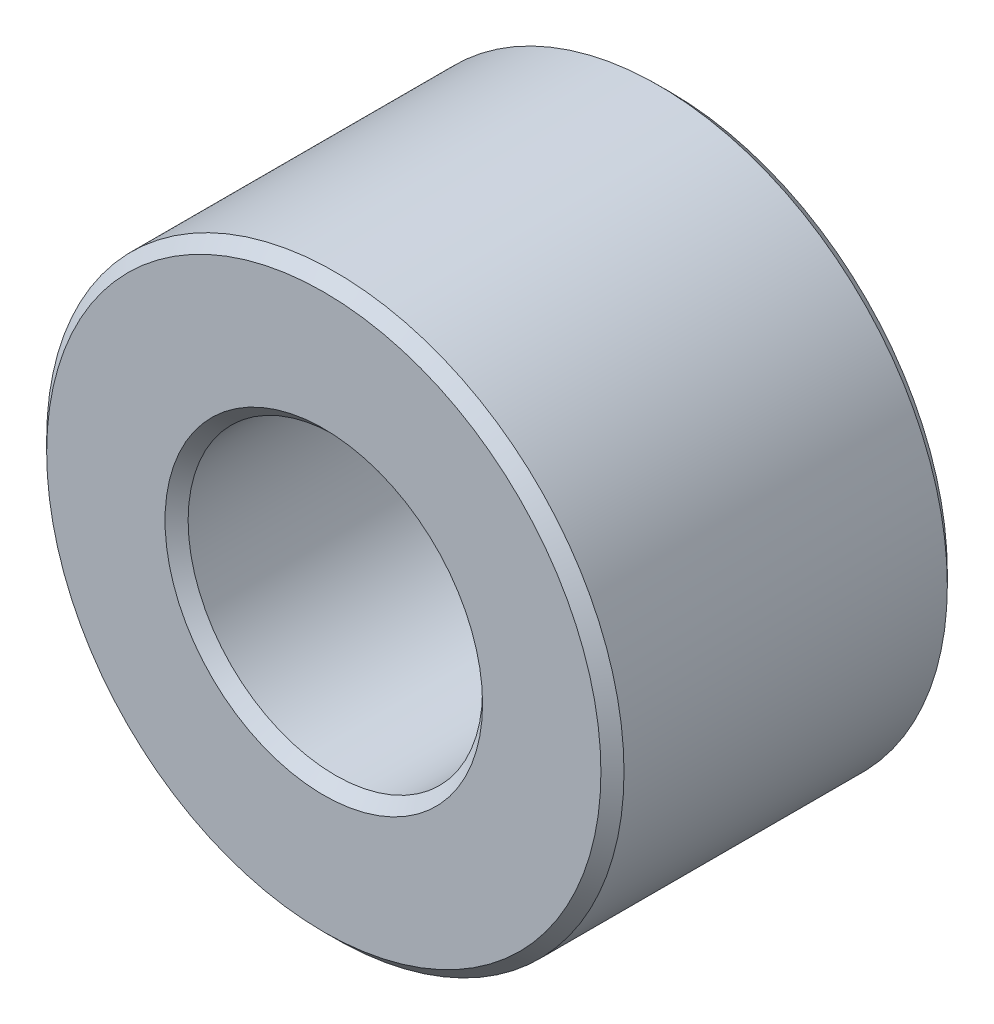
ISO-10303-21;
HEADER;
FILE_DESCRIPTION(('STEP AP214'),'2;1');
FILE_NAME('part.step','',(''),(''),'','','');
FILE_SCHEMA(('AUTOMOTIVE_DESIGN { 1 0 10303 214 1 1 1 1 }'));
ENDSEC;
DATA;
#1=APPLICATION_CONTEXT('core data for automotive mechanical design processes');
#2=APPLICATION_PROTOCOL_DEFINITION('international standard','automotive_design',2000,#1);
#3=PRODUCT_CONTEXT('',#1,'mechanical');
#4=PRODUCT('Part','Part','',(#3));
#5=PRODUCT_RELATED_PRODUCT_CATEGORY('part','',(#4));
#6=PRODUCT_DEFINITION_FORMATION('','',#4);
#7=PRODUCT_DEFINITION_CONTEXT('part definition',#1,'design');
#8=PRODUCT_DEFINITION('design','',#6,#7);
#9=PRODUCT_DEFINITION_SHAPE('','',#8);
#10=(LENGTH_UNIT() NAMED_UNIT(*) SI_UNIT(.MILLI.,.METRE.));
#11=(NAMED_UNIT(*) PLANE_ANGLE_UNIT() SI_UNIT($,.RADIAN.));
#12=(NAMED_UNIT(*) SI_UNIT($,.STERADIAN.) SOLID_ANGLE_UNIT());
#13=UNCERTAINTY_MEASURE_WITH_UNIT(LENGTH_MEASURE(1.E-05),#10,'distance_accuracy_value','');
#14=(GEOMETRIC_REPRESENTATION_CONTEXT(3) GLOBAL_UNCERTAINTY_ASSIGNED_CONTEXT((#13)) GLOBAL_UNIT_ASSIGNED_CONTEXT((#10,
#11,#12)) REPRESENTATION_CONTEXT('',''));
#15=CARTESIAN_POINT('',(0.,0.,0.));
#16=DIRECTION('',(0.,0.,1.));
#17=DIRECTION('',(1.,0.,0.));
#18=AXIS2_PLACEMENT_3D('',#15,#16,#17);
#19=CARTESIAN_POINT('',(0.,0.,6.));
#20=DIRECTION('',(0.,0.,1.));
#21=DIRECTION('',(1.,0.,0.));
#22=AXIS2_PLACEMENT_3D('',#19,#20,#21);
#23=PLANE('',#22);
#24=CARTESIAN_POINT('',(0.,0.,6.));
#25=DIRECTION('',(0.,0.,1.));
#26=DIRECTION('',(1.,0.,0.));
#27=AXIS2_PLACEMENT_3D('',#24,#25,#26);
#28=CIRCLE('',#27,2.75);
#29=CARTESIAN_POINT('',(2.75,0.,6.));
#30=VERTEX_POINT('',#29);
#31=EDGE_CURVE('E10',#30,#30,#28,.F.);
#32=ORIENTED_EDGE('',*,*,#31,.T.);
#33=EDGE_LOOP('',(#32));
#34=FACE_BOUND('',#33,.T.);
#35=CARTESIAN_POINT('',(0.,0.,6.));
#36=DIRECTION('',(0.,0.,1.));
#37=DIRECTION('',(1.,0.,0.));
#38=AXIS2_PLACEMENT_3D('',#35,#36,#37);
#39=CIRCLE('',#38,4.8);
#40=CARTESIAN_POINT('',(4.8,0.,6.));
#41=VERTEX_POINT('',#40);
#42=EDGE_CURVE('E39',#41,#41,#39,.T.);
#43=ORIENTED_EDGE('',*,*,#42,.T.);
#44=EDGE_LOOP('',(#43));
#45=FACE_BOUND('',#44,.T.);
#46=ADVANCED_FACE('F32',(#34,#45),#23,.T.);
#47=CARTESIAN_POINT('',(0.,0.,0.));
#48=DIRECTION('',(0.,0.,1.));
#49=DIRECTION('',(1.,0.,0.));
#50=AXIS2_PLACEMENT_3D('',#47,#48,#49);
#51=PLANE('',#50);
#52=CARTESIAN_POINT('',(0.,0.,0.));
#53=DIRECTION('',(0.,0.,1.));
#54=DIRECTION('',(1.,0.,0.));
#55=AXIS2_PLACEMENT_3D('',#52,#53,#54);
#56=CIRCLE('',#55,4.8);
#57=CARTESIAN_POINT('',(4.8,0.,0.));
#58=VERTEX_POINT('',#57);
#59=EDGE_CURVE('E56',#58,#58,#56,.F.);
#60=ORIENTED_EDGE('',*,*,#59,.T.);
#61=EDGE_LOOP('',(#60));
#62=FACE_BOUND('',#61,.T.);
#63=CARTESIAN_POINT('',(0.,0.,0.));
#64=DIRECTION('',(0.,0.,1.));
#65=DIRECTION('',(1.,0.,0.));
#66=AXIS2_PLACEMENT_3D('',#63,#64,#65);
#67=CIRCLE('',#66,2.75);
#68=CARTESIAN_POINT('',(2.75,0.,0.));
#69=VERTEX_POINT('',#68);
#70=EDGE_CURVE('E59',#69,#69,#67,.T.);
#71=ORIENTED_EDGE('',*,*,#70,.T.);
#72=EDGE_LOOP('',(#71));
#73=FACE_BOUND('',#72,.T.);
#74=ADVANCED_FACE('F82',(#62,#73),#51,.F.);
#75=CARTESIAN_POINT('',(0.,0.,6.));
#76=DIRECTION('',(0.,0.,-1.));
#77=DIRECTION('',(-1.,0.,0.));
#78=AXIS2_PLACEMENT_3D('',#75,#76,#77);
#79=CYLINDRICAL_SURFACE('',#78,5.);
#80=CARTESIAN_POINT('',(0.,0.,0.199999999999998));
#81=DIRECTION('',(0.,0.,1.));
#82=DIRECTION('',(1.,0.,0.));
#83=AXIS2_PLACEMENT_3D('',#80,#81,#82);
#84=CIRCLE('',#83,5.);
#85=CARTESIAN_POINT('',(5.,0.,0.199999999999998));
#86=VERTEX_POINT('',#85);
#87=EDGE_CURVE('E63',#86,#86,#84,.T.);
#88=ORIENTED_EDGE('',*,*,#87,.T.);
#89=EDGE_LOOP('',(#88));
#90=FACE_BOUND('',#89,.T.);
#91=CARTESIAN_POINT('',(0.,0.,5.8));
#92=DIRECTION('',(0.,0.,1.));
#93=DIRECTION('',(1.,0.,0.));
#94=AXIS2_PLACEMENT_3D('',#91,#92,#93);
#95=CIRCLE('',#94,5.);
#96=CARTESIAN_POINT('',(5.,0.,5.8));
#97=VERTEX_POINT('',#96);
#98=EDGE_CURVE('E66',#97,#97,#95,.F.);
#99=ORIENTED_EDGE('',*,*,#98,.T.);
#100=EDGE_LOOP('',(#99));
#101=FACE_BOUND('',#100,.T.);
#102=ADVANCED_FACE('F71',(#90,#101),#79,.T.);
#103=CARTESIAN_POINT('',(0.,0.,6.));
#104=DIRECTION('',(0.,0.,-1.));
#105=DIRECTION('',(-1.,0.,0.));
#106=AXIS2_PLACEMENT_3D('',#103,#104,#105);
#107=CYLINDRICAL_SURFACE('',#106,2.55);
#108=CARTESIAN_POINT('',(0.,0.,0.200000000000003));
#109=DIRECTION('',(0.,0.,1.));
#110=DIRECTION('',(1.,0.,0.));
#111=AXIS2_PLACEMENT_3D('',#108,#109,#110);
#112=CIRCLE('',#111,2.55);
#113=CARTESIAN_POINT('',(2.55,0.,0.200000000000003));
#114=VERTEX_POINT('',#113);
#115=EDGE_CURVE('E44',#114,#114,#112,.F.);
#116=ORIENTED_EDGE('',*,*,#115,.T.);
#117=EDGE_LOOP('',(#116));
#118=FACE_BOUND('',#117,.T.);
#119=CARTESIAN_POINT('',(0.,0.,5.8));
#120=DIRECTION('',(0.,0.,1.));
#121=DIRECTION('',(1.,0.,0.));
#122=AXIS2_PLACEMENT_3D('',#119,#120,#121);
#123=CIRCLE('',#122,2.55);
#124=CARTESIAN_POINT('',(2.55,0.,5.8));
#125=VERTEX_POINT('',#124);
#126=EDGE_CURVE('E51',#125,#125,#123,.T.);
#127=ORIENTED_EDGE('',*,*,#126,.T.);
#128=EDGE_LOOP('',(#127));
#129=FACE_BOUND('',#128,.T.);
#130=ADVANCED_FACE('F90',(#118,#129),#107,.F.);
#131=CARTESIAN_POINT('',(0.,0.,0.199999999999998));
#132=DIRECTION('',(0.,0.,1.));
#133=DIRECTION('',(1.,0.,0.));
#134=AXIS2_PLACEMENT_3D('',#131,#132,#133);
#135=CONICAL_SURFACE('',#134,5.,0.785398163397455);
#136=ORIENTED_EDGE('',*,*,#59,.F.);
#137=EDGE_LOOP('',(#136));
#138=FACE_BOUND('',#137,.T.);
#139=ORIENTED_EDGE('',*,*,#87,.F.);
#140=EDGE_LOOP('',(#139));
#141=FACE_BOUND('',#140,.T.);
#142=ADVANCED_FACE('F95',(#138,#141),#135,.T.);
#143=CARTESIAN_POINT('',(0.,0.,0.));
#144=DIRECTION('',(0.,0.,-1.));
#145=DIRECTION('',(-1.,0.,0.));
#146=AXIS2_PLACEMENT_3D('',#143,#144,#145);
#147=CONICAL_SURFACE('',#146,2.75,0.785398163397443);
#148=ORIENTED_EDGE('',*,*,#115,.F.);
#149=EDGE_LOOP('',(#148));
#150=FACE_BOUND('',#149,.T.);
#151=ORIENTED_EDGE('',*,*,#70,.F.);
#152=EDGE_LOOP('',(#151));
#153=FACE_BOUND('',#152,.T.);
#154=ADVANCED_FACE('F79',(#150,#153),#147,.F.);
#155=CARTESIAN_POINT('',(0.,0.,5.8));
#156=DIRECTION('',(0.,0.,1.));
#157=DIRECTION('',(1.,0.,0.));
#158=AXIS2_PLACEMENT_3D('',#155,#156,#157);
#159=CONICAL_SURFACE('',#158,2.55,0.785398163397454);
#160=ORIENTED_EDGE('',*,*,#31,.F.);
#161=EDGE_LOOP('',(#160));
#162=FACE_BOUND('',#161,.T.);
#163=ORIENTED_EDGE('',*,*,#126,.F.);
#164=EDGE_LOOP('',(#163));
#165=FACE_BOUND('',#164,.T.);
#166=ADVANCED_FACE('F75',(#162,#165),#159,.F.);
#167=CARTESIAN_POINT('',(0.,0.,6.));
#168=DIRECTION('',(0.,0.,-1.));
#169=DIRECTION('',(-1.,0.,0.));
#170=AXIS2_PLACEMENT_3D('',#167,#168,#169);
#171=CONICAL_SURFACE('',#170,4.8,0.785398163397448);
#172=ORIENTED_EDGE('',*,*,#98,.F.);
#173=EDGE_LOOP('',(#172));
#174=FACE_BOUND('',#173,.T.);
#175=ORIENTED_EDGE('',*,*,#42,.F.);
#176=EDGE_LOOP('',(#175));
#177=FACE_BOUND('',#176,.T.);
#178=ADVANCED_FACE('F34',(#174,#177),#171,.T.);
#179=CLOSED_SHELL('',(#46,#74,#102,#130,#142,#154,#166,#178));
#180=MANIFOLD_SOLID_BREP('B2',#179);
#181=ADVANCED_BREP_SHAPE_REPRESENTATION('',(#18,#180),#14);
#182=SHAPE_DEFINITION_REPRESENTATION(#9,#181);
ENDSEC;
END-ISO-10303-21;
